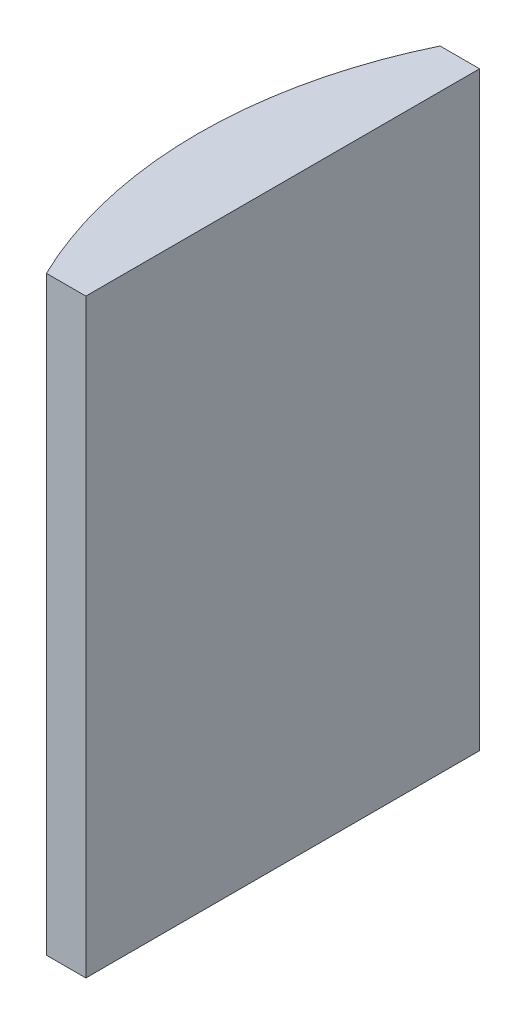
ISO-10303-21;
HEADER;
FILE_DESCRIPTION(('STEP AP214'),'2;1');
FILE_NAME('part.step','',(''),(''),'','','');
FILE_SCHEMA(('AUTOMOTIVE_DESIGN { 1 0 10303 214 1 1 1 1 }'));
ENDSEC;
DATA;
#1=APPLICATION_CONTEXT('core data for automotive mechanical design processes');
#2=APPLICATION_PROTOCOL_DEFINITION('international standard','automotive_design',2000,#1);
#3=PRODUCT_CONTEXT('',#1,'mechanical');
#4=PRODUCT('Part','Part','',(#3));
#5=PRODUCT_RELATED_PRODUCT_CATEGORY('part','',(#4));
#6=PRODUCT_DEFINITION_FORMATION('','',#4);
#7=PRODUCT_DEFINITION_CONTEXT('part definition',#1,'design');
#8=PRODUCT_DEFINITION('design','',#6,#7);
#9=PRODUCT_DEFINITION_SHAPE('','',#8);
#10=(LENGTH_UNIT() NAMED_UNIT(*) SI_UNIT(.MILLI.,.METRE.));
#11=(NAMED_UNIT(*) PLANE_ANGLE_UNIT() SI_UNIT($,.RADIAN.));
#12=(NAMED_UNIT(*) SI_UNIT($,.STERADIAN.) SOLID_ANGLE_UNIT());
#13=UNCERTAINTY_MEASURE_WITH_UNIT(LENGTH_MEASURE(1.E-05),#10,'distance_accuracy_value','');
#14=(GEOMETRIC_REPRESENTATION_CONTEXT(3) GLOBAL_UNCERTAINTY_ASSIGNED_CONTEXT((#13)) GLOBAL_UNIT_ASSIGNED_CONTEXT((#10,
#11,#12)) REPRESENTATION_CONTEXT('',''));
#15=CARTESIAN_POINT('',(0.,0.,0.));
#16=DIRECTION('',(0.,0.,1.));
#17=DIRECTION('',(1.,0.,0.));
#18=AXIS2_PLACEMENT_3D('',#15,#16,#17);
#19=CARTESIAN_POINT('',(4.35520433485127,30.,0.));
#20=DIRECTION('',(0.,-1.,0.));
#21=DIRECTION('',(0.,0.,-1.));
#22=AXIS2_PLACEMENT_3D('',#19,#20,#21);
#23=CYLINDRICAL_SURFACE('',#22,22.92);
#24=CARTESIAN_POINT('',(4.35520433485127,0.,0.));
#25=DIRECTION('',(0.,1.,0.));
#26=DIRECTION('',(0.,0.,1.));
#27=AXIS2_PLACEMENT_3D('',#24,#25,#26);
#28=CIRCLE('',#27,22.92);
#29=CARTESIAN_POINT('',(-16.2682386366799,0.,-10.));
#30=VERTEX_POINT('',#29);
#31=CARTESIAN_POINT('',(-16.2682386366799,0.,10.));
#32=VERTEX_POINT('',#31);
#33=EDGE_CURVE('E100',#30,#32,#28,.T.);
#34=ORIENTED_EDGE('',*,*,#33,.T.);
#35=DIRECTION('',(0.,-1.,0.));
#36=VECTOR('',#35,1.);
#37=CARTESIAN_POINT('',(-16.2682386366799,30.,10.));
#38=LINE('',#37,#36);
#39=CARTESIAN_POINT('',(-16.2682386366799,30.,10.));
#40=VERTEX_POINT('',#39);
#41=EDGE_CURVE('E11',#40,#32,#38,.T.);
#42=ORIENTED_EDGE('',*,*,#41,.F.);
#43=CARTESIAN_POINT('',(4.35520433485127,30.,0.));
#44=DIRECTION('',(0.,1.,0.));
#45=DIRECTION('',(0.,0.,1.));
#46=AXIS2_PLACEMENT_3D('',#43,#44,#45);
#47=CIRCLE('',#46,22.92);
#48=CARTESIAN_POINT('',(-16.2682386366799,30.,-10.));
#49=VERTEX_POINT('',#48);
#50=EDGE_CURVE('E88',#49,#40,#47,.T.);
#51=ORIENTED_EDGE('',*,*,#50,.F.);
#52=DIRECTION('',(0.,-1.,0.));
#53=VECTOR('',#52,1.);
#54=CARTESIAN_POINT('',(-16.2682386366799,30.,-10.));
#55=LINE('',#54,#53);
#56=EDGE_CURVE('E96',#49,#30,#55,.T.);
#57=ORIENTED_EDGE('',*,*,#56,.T.);
#58=EDGE_LOOP('',(#34,#42,#51,#57));
#59=FACE_BOUND('',#58,.T.);
#60=ADVANCED_FACE('F37',(#59),#23,.T.);
#61=CARTESIAN_POINT('',(-16.2682386366799,30.,10.));
#62=DIRECTION('',(0.,0.,-1.));
#63=DIRECTION('',(-1.,0.,0.));
#64=AXIS2_PLACEMENT_3D('',#61,#62,#63);
#65=PLANE('',#64);
#66=DIRECTION('',(1.,0.,0.));
#67=VECTOR('',#66,1.);
#68=CARTESIAN_POINT('',(-16.2682386366799,0.,10.));
#69=LINE('',#68,#67);
#70=CARTESIAN_POINT('',(-14.2647956651487,0.,10.));
#71=VERTEX_POINT('',#70);
#72=EDGE_CURVE('E92',#32,#71,#69,.T.);
#73=ORIENTED_EDGE('',*,*,#72,.T.);
#74=DIRECTION('',(0.,-1.,0.));
#75=VECTOR('',#74,1.);
#76=CARTESIAN_POINT('',(-14.2647956651487,30.,10.));
#77=LINE('',#76,#75);
#78=CARTESIAN_POINT('',(-14.2647956651487,30.,10.));
#79=VERTEX_POINT('',#78);
#80=EDGE_CURVE('E45',#79,#71,#77,.T.);
#81=ORIENTED_EDGE('',*,*,#80,.F.);
#82=DIRECTION('',(1.,0.,0.));
#83=VECTOR('',#82,1.);
#84=CARTESIAN_POINT('',(-16.2682386366799,30.,10.));
#85=LINE('',#84,#83);
#86=EDGE_CURVE('E83',#40,#79,#85,.T.);
#87=ORIENTED_EDGE('',*,*,#86,.F.);
#88=ORIENTED_EDGE('',*,*,#41,.T.);
#89=EDGE_LOOP('',(#73,#81,#87,#88));
#90=FACE_BOUND('',#89,.T.);
#91=ADVANCED_FACE('F91',(#90),#65,.F.);
#92=CARTESIAN_POINT('',(-14.2647956651487,30.,-10.));
#93=DIRECTION('',(-1.,0.,0.));
#94=DIRECTION('',(0.,0.,1.));
#95=AXIS2_PLACEMENT_3D('',#92,#93,#94);
#96=PLANE('',#95);
#97=DIRECTION('',(0.,0.,-1.));
#98=VECTOR('',#97,1.);
#99=CARTESIAN_POINT('',(-14.2647956651487,0.,-10.));
#100=LINE('',#99,#98);
#101=CARTESIAN_POINT('',(-14.2647956651487,0.,-10.));
#102=VERTEX_POINT('',#101);
#103=EDGE_CURVE('E70',#71,#102,#100,.T.);
#104=ORIENTED_EDGE('',*,*,#103,.T.);
#105=DIRECTION('',(0.,-1.,0.));
#106=VECTOR('',#105,1.);
#107=CARTESIAN_POINT('',(-14.2647956651487,30.,-10.));
#108=LINE('',#107,#106);
#109=CARTESIAN_POINT('',(-14.2647956651487,30.,-10.));
#110=VERTEX_POINT('',#109);
#111=EDGE_CURVE('E93',#110,#102,#108,.T.);
#112=ORIENTED_EDGE('',*,*,#111,.F.);
#113=DIRECTION('',(0.,0.,-1.));
#114=VECTOR('',#113,1.);
#115=CARTESIAN_POINT('',(-14.2647956651487,30.,-10.));
#116=LINE('',#115,#114);
#117=EDGE_CURVE('E86',#79,#110,#116,.T.);
#118=ORIENTED_EDGE('',*,*,#117,.F.);
#119=ORIENTED_EDGE('',*,*,#80,.T.);
#120=EDGE_LOOP('',(#104,#112,#118,#119));
#121=FACE_BOUND('',#120,.T.);
#122=ADVANCED_FACE('F94',(#121),#96,.F.);
#123=CARTESIAN_POINT('',(-16.2682386366799,30.,-10.));
#124=DIRECTION('',(0.,0.,1.));
#125=DIRECTION('',(1.,0.,0.));
#126=AXIS2_PLACEMENT_3D('',#123,#124,#125);
#127=PLANE('',#126);
#128=DIRECTION('',(-1.,0.,0.));
#129=VECTOR('',#128,1.);
#130=CARTESIAN_POINT('',(-16.2682386366799,0.,-10.));
#131=LINE('',#130,#129);
#132=EDGE_CURVE('E76',#102,#30,#131,.T.);
#133=ORIENTED_EDGE('',*,*,#132,.T.);
#134=ORIENTED_EDGE('',*,*,#56,.F.);
#135=DIRECTION('',(-1.,0.,0.));
#136=VECTOR('',#135,1.);
#137=CARTESIAN_POINT('',(-16.2682386366799,30.,-10.));
#138=LINE('',#137,#136);
#139=EDGE_CURVE('E53',#110,#49,#138,.T.);
#140=ORIENTED_EDGE('',*,*,#139,.F.);
#141=ORIENTED_EDGE('',*,*,#111,.T.);
#142=EDGE_LOOP('',(#133,#134,#140,#141));
#143=FACE_BOUND('',#142,.T.);
#144=ADVANCED_FACE('F107',(#143),#127,.F.);
#145=CARTESIAN_POINT('',(4.35520433485127,30.,0.));
#146=DIRECTION('',(0.,1.,0.));
#147=DIRECTION('',(0.,0.,1.));
#148=AXIS2_PLACEMENT_3D('',#145,#146,#147);
#149=PLANE('',#148);
#150=ORIENTED_EDGE('',*,*,#50,.T.);
#151=ORIENTED_EDGE('',*,*,#86,.T.);
#152=ORIENTED_EDGE('',*,*,#117,.T.);
#153=ORIENTED_EDGE('',*,*,#139,.T.);
#154=EDGE_LOOP('',(#150,#151,#152,#153));
#155=FACE_BOUND('',#154,.T.);
#156=ADVANCED_FACE('F84',(#155),#149,.T.);
#157=CARTESIAN_POINT('',(4.35520433485127,0.,0.));
#158=DIRECTION('',(0.,1.,0.));
#159=DIRECTION('',(0.,0.,1.));
#160=AXIS2_PLACEMENT_3D('',#157,#158,#159);
#161=PLANE('',#160);
#162=ORIENTED_EDGE('',*,*,#33,.F.);
#163=ORIENTED_EDGE('',*,*,#132,.F.);
#164=ORIENTED_EDGE('',*,*,#103,.F.);
#165=ORIENTED_EDGE('',*,*,#72,.F.);
#166=EDGE_LOOP('',(#162,#163,#164,#165));
#167=FACE_BOUND('',#166,.T.);
#168=ADVANCED_FACE('F110',(#167),#161,.F.);
#169=CLOSED_SHELL('',(#60,#91,#122,#144,#156,#168));
#170=MANIFOLD_SOLID_BREP('B2',#169);
#171=ADVANCED_BREP_SHAPE_REPRESENTATION('',(#18,#170),#14);
#172=SHAPE_DEFINITION_REPRESENTATION(#9,#171);
ENDSEC;
END-ISO-10303-21;
